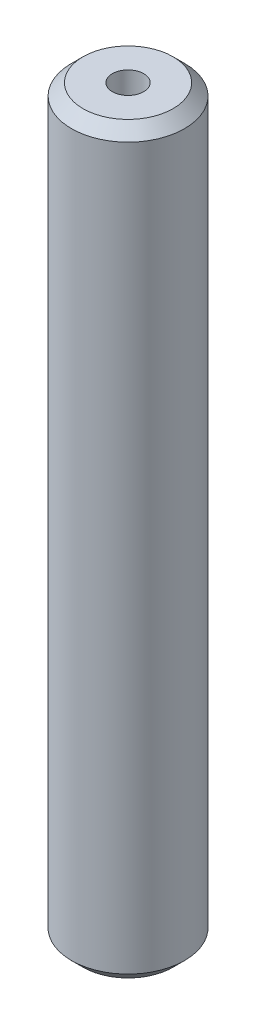
ISO-10303-21;
HEADER;
FILE_DESCRIPTION(('STEP AP214'),'2;1');
FILE_NAME('part.step','',(''),(''),'','','');
FILE_SCHEMA(('AUTOMOTIVE_DESIGN { 1 0 10303 214 1 1 1 1 }'));
ENDSEC;
DATA;
#1=APPLICATION_CONTEXT('core data for automotive mechanical design processes');
#2=APPLICATION_PROTOCOL_DEFINITION('international standard','automotive_design',2000,#1);
#3=PRODUCT_CONTEXT('',#1,'mechanical');
#4=PRODUCT('Part','Part','',(#3));
#5=PRODUCT_RELATED_PRODUCT_CATEGORY('part','',(#4));
#6=PRODUCT_DEFINITION_FORMATION('','',#4);
#7=PRODUCT_DEFINITION_CONTEXT('part definition',#1,'design');
#8=PRODUCT_DEFINITION('design','',#6,#7);
#9=PRODUCT_DEFINITION_SHAPE('','',#8);
#10=(LENGTH_UNIT() NAMED_UNIT(*) SI_UNIT(.MILLI.,.METRE.));
#11=(NAMED_UNIT(*) PLANE_ANGLE_UNIT() SI_UNIT($,.RADIAN.));
#12=(NAMED_UNIT(*) SI_UNIT($,.STERADIAN.) SOLID_ANGLE_UNIT());
#13=UNCERTAINTY_MEASURE_WITH_UNIT(LENGTH_MEASURE(1.E-05),#10,'distance_accuracy_value','');
#14=(GEOMETRIC_REPRESENTATION_CONTEXT(3) GLOBAL_UNCERTAINTY_ASSIGNED_CONTEXT((#13)) GLOBAL_UNIT_ASSIGNED_CONTEXT((#10,
#11,#12)) REPRESENTATION_CONTEXT('',''));
#15=CARTESIAN_POINT('',(0.,0.,0.));
#16=DIRECTION('',(0.,0.,1.));
#17=DIRECTION('',(1.,0.,0.));
#18=AXIS2_PLACEMENT_3D('',#15,#16,#17);
#19=CARTESIAN_POINT('',(0.,164.353961571548,0.));
#20=DIRECTION('',(0.,-1.,0.));
#21=DIRECTION('',(0.,0.,-1.));
#22=AXIS2_PLACEMENT_3D('',#19,#20,#21);
#23=CYLINDRICAL_SURFACE('',#22,12.5);
#24=CARTESIAN_POINT('',(0.,161.802368957981,0.));
#25=DIRECTION('',(0.,1.,0.));
#26=DIRECTION('',(0.,0.,1.));
#27=AXIS2_PLACEMENT_3D('',#24,#25,#26);
#28=CIRCLE('',#27,12.5);
#29=CARTESIAN_POINT('',(0.,161.802368957981,-12.5));
#30=VERTEX_POINT('',#29);
#31=EDGE_CURVE('E50',#30,#30,#28,.F.);
#32=CARTESIAN_POINT('',(0.,2.55159261356797,0.));
#33=DIRECTION('',(0.,1.,0.));
#34=DIRECTION('',(0.,0.,1.));
#35=AXIS2_PLACEMENT_3D('',#32,#33,#34);
#36=CIRCLE('',#35,12.5);
#37=CARTESIAN_POINT('',(0.,2.55159261356797,-12.5));
#38=VERTEX_POINT('',#37);
#39=EDGE_CURVE('E51',#38,#38,#36,.T.);
#40=CARTESIAN_POINT('',(0.,161.802368957981,-12.5));
#41=CARTESIAN_POINT('',(0.,160.143506704393,-12.5));
#42=CARTESIAN_POINT('',(0.,158.484644450805,-12.5));
#43=CARTESIAN_POINT('',(0.,155.16691994363,-12.5));
#44=CARTESIAN_POINT('',(0.,153.508057690042,-12.5));
#45=CARTESIAN_POINT('',(0.,150.190333182867,-12.5));
#46=CARTESIAN_POINT('',(0.,148.53147092928,-12.5));
#47=CARTESIAN_POINT('',(0.,145.213746422104,-12.5));
#48=CARTESIAN_POINT('',(0.,143.554884168517,-12.5));
#49=CARTESIAN_POINT('',(0.,140.237159661341,-12.5));
#50=CARTESIAN_POINT('',(0.,138.578297407754,-12.5));
#51=CARTESIAN_POINT('',(0.,135.260572900578,-12.5));
#52=CARTESIAN_POINT('',(0.,133.601710646991,-12.5));
#53=CARTESIAN_POINT('',(0.,130.283986139816,-12.5));
#54=CARTESIAN_POINT('',(0.,128.625123886228,-12.5));
#55=CARTESIAN_POINT('',(0.,125.307399379053,-12.5));
#56=CARTESIAN_POINT('',(0.,123.648537125465,-12.5));
#57=CARTESIAN_POINT('',(0.,120.33081261829,-12.5));
#58=CARTESIAN_POINT('',(0.,118.671950364702,-12.5));
#59=CARTESIAN_POINT('',(0.,115.354225857527,-12.5));
#60=CARTESIAN_POINT('',(0.,113.695363603939,-12.5));
#61=CARTESIAN_POINT('',(0.,110.377639096764,-12.5));
#62=CARTESIAN_POINT('',(0.,108.718776843176,-12.5));
#63=CARTESIAN_POINT('',(0.,105.401052336001,-12.5));
#64=CARTESIAN_POINT('',(0.,103.742190082414,-12.5));
#65=CARTESIAN_POINT('',(0.,100.424465575238,-12.5));
#66=CARTESIAN_POINT('',(0.,98.7656033216506,-12.5));
#67=CARTESIAN_POINT('',(0.,95.4478788144753,-12.5));
#68=CARTESIAN_POINT('',(0.,93.7890165608877,-12.5));
#69=CARTESIAN_POINT('',(0.,90.4712920537124,-12.5));
#70=CARTESIAN_POINT('',(0.,88.8124298001248,-12.5));
#71=CARTESIAN_POINT('',(0.,85.4947052929496,-12.5));
#72=CARTESIAN_POINT('',(0.,83.8358430393619,-12.5));
#73=CARTESIAN_POINT('',(0.,80.5181185321867,-12.5));
#74=CARTESIAN_POINT('',(0.,78.859256278599,-12.5));
#75=CARTESIAN_POINT('',(0.,75.5415317714237,-12.5));
#76=CARTESIAN_POINT('',(0.,73.8826695178361,-12.5));
#77=CARTESIAN_POINT('',(0.,70.5649450106609,-12.5));
#78=CARTESIAN_POINT('',(0.,68.9060827570732,-12.5));
#79=CARTESIAN_POINT('',(0.,65.588358249898,-12.5));
#80=CARTESIAN_POINT('',(0.,63.9294959963103,-12.5));
#81=CARTESIAN_POINT('',(0.,60.6117714891351,-12.5));
#82=CARTESIAN_POINT('',(0.,58.9529092355474,-12.5));
#83=CARTESIAN_POINT('',(0.,55.6351847283722,-12.5));
#84=CARTESIAN_POINT('',(0.,53.9763224747845,-12.5));
#85=CARTESIAN_POINT('',(0.,50.6585979676093,-12.5));
#86=CARTESIAN_POINT('',(0.,48.9997357140217,-12.5));
#87=CARTESIAN_POINT('',(0.,45.6820112068464,-12.5));
#88=CARTESIAN_POINT('',(0.,44.0231489532588,-12.5));
#89=CARTESIAN_POINT('',(0.,40.7054244460835,-12.5));
#90=CARTESIAN_POINT('',(0.,39.0465621924959,-12.5));
#91=CARTESIAN_POINT('',(0.,35.7288376853206,-12.5));
#92=CARTESIAN_POINT('',(0.,34.069975431733,-12.5));
#93=CARTESIAN_POINT('',(0.,30.7522509245577,-12.5));
#94=CARTESIAN_POINT('',(0.,29.0933886709701,-12.5));
#95=CARTESIAN_POINT('',(0.,25.7756641637948,-12.5));
#96=CARTESIAN_POINT('',(0.,24.1168019102072,-12.5));
#97=CARTESIAN_POINT('',(0.,20.7990774030319,-12.5));
#98=CARTESIAN_POINT('',(0.,19.1402151494443,-12.5));
#99=CARTESIAN_POINT('',(0.,15.822490642269,-12.5));
#100=CARTESIAN_POINT('',(0.,14.1636283886814,-12.5));
#101=CARTESIAN_POINT('',(0.,10.8459038815061,-12.5));
#102=CARTESIAN_POINT('',(0.,9.1870416279185,-12.5));
#103=CARTESIAN_POINT('',(0.,5.86931712074323,-12.5));
#104=CARTESIAN_POINT('',(0.,4.2104548671556,-12.5));
#105=CARTESIAN_POINT('',(0.,2.55159261356797,-12.5));
#106=B_SPLINE_CURVE_WITH_KNOTS('',3,(#40,#41,#42,#43,#44,#45,#46,#47,#48,#49,#50,#51,#52,#53,
#54,#55,#56,#57,#58,#59,#60,#61,#62,#63,#64,#65,#66,#67,#68,#69,#70,#71,#72,#73,#74,#75,#76,#77,
#78,#79,#80,#81,#82,#83,#84,#85,#86,#87,#88,#89,#90,#91,#92,#93,#94,#95,#96,#97,#98,#99,#100,
#101,#102,#103,#104,#105),.UNSPECIFIED.,.F.,.F.,(4,2,2,2,2,2,2,2,2,2,2,2,2,2,2,2,2,2,2,2,2,2,2,
2,2,2,2,2,2,2,2,2,4),(0.,4.97658676076287,9.95317352152578,14.9297602822887,19.9063470430516,
24.8829338038145,29.8595205645774,34.8361073253402,39.8126940861031,44.789280846866,
49.7658676076289,54.7424543683918,59.7190411291547,64.6956278899176,69.6722146506805,
74.6488014114434,79.6253881722063,84.6019749329692,89.5785616937321,94.555148454495,
99.5317352152579,104.508321976021,109.484908736784,114.461495497547,119.438082258309,
124.414669019072,129.391255779835,134.367842540598,139.344429301361,144.321016062124,
149.297602822887,154.27418958365,159.250776344413),.UNSPECIFIED.);
#107=EDGE_CURVE('BSEAM39',#30,#38,#106,.T.);
#108=ORIENTED_EDGE('',*,*,#31,.T.);
#109=ORIENTED_EDGE('',*,*,#39,.T.);
#110=ORIENTED_EDGE('',*,*,#107,.T.);
#111=ORIENTED_EDGE('',*,*,#107,.F.);
#112=EDGE_LOOP('',(#108,#110,#109,#111));
#113=FACE_BOUND('',#112,.T.);
#114=ADVANCED_FACE('F39',(#113),#23,.T.);
#115=CARTESIAN_POINT('',(0.,164.353961571548,0.));
#116=DIRECTION('',(0.,1.,0.));
#117=DIRECTION('',(0.,0.,1.));
#118=AXIS2_PLACEMENT_3D('',#115,#116,#117);
#119=PLANE('',#118);
#120=CARTESIAN_POINT('',(0.,164.353961571548,0.));
#121=DIRECTION('',(0.,1.,0.));
#122=DIRECTION('',(0.,0.,1.));
#123=AXIS2_PLACEMENT_3D('',#120,#121,#122);
#124=CIRCLE('',#123,9.94840738643229);
#125=CARTESIAN_POINT('',(0.,164.353961571548,9.94840738643229));
#126=VERTEX_POINT('',#125);
#127=EDGE_CURVE('E54',#126,#126,#124,.T.);
#128=ORIENTED_EDGE('',*,*,#127,.T.);
#129=EDGE_LOOP('',(#128));
#130=FACE_BOUND('',#129,.T.);
#131=CARTESIAN_POINT('',(0.,164.353961571548,0.));
#132=DIRECTION('',(0.,1.,0.));
#133=DIRECTION('',(0.,0.,1.));
#134=AXIS2_PLACEMENT_3D('',#131,#132,#133);
#135=CIRCLE('',#134,3.46270329114261);
#136=CARTESIAN_POINT('',(0.,164.353961571548,-3.46270329114261));
#137=VERTEX_POINT('',#136);
#138=EDGE_CURVE('E58',#137,#137,#135,.T.);
#139=ORIENTED_EDGE('',*,*,#138,.F.);
#140=EDGE_LOOP('',(#139));
#141=FACE_BOUND('',#140,.T.);
#142=ADVANCED_FACE('F69',(#130,#141),#119,.T.);
#143=CARTESIAN_POINT('',(0.,0.,0.));
#144=DIRECTION('',(0.,1.,0.));
#145=DIRECTION('',(0.,0.,1.));
#146=AXIS2_PLACEMENT_3D('',#143,#144,#145);
#147=PLANE('',#146);
#148=CARTESIAN_POINT('',(0.,0.,0.));
#149=DIRECTION('',(0.,1.,0.));
#150=DIRECTION('',(0.,0.,1.));
#151=AXIS2_PLACEMENT_3D('',#148,#149,#150);
#152=CIRCLE('',#151,9.94840738643202);
#153=CARTESIAN_POINT('',(0.,0.,9.94840738643202));
#154=VERTEX_POINT('',#153);
#155=EDGE_CURVE('E10',#154,#154,#152,.F.);
#156=ORIENTED_EDGE('',*,*,#155,.T.);
#157=EDGE_LOOP('',(#156));
#158=FACE_BOUND('',#157,.T.);
#159=CARTESIAN_POINT('',(0.,0.,0.));
#160=DIRECTION('',(0.,1.,0.));
#161=DIRECTION('',(0.,0.,1.));
#162=AXIS2_PLACEMENT_3D('',#159,#160,#161);
#163=CIRCLE('',#162,3.46270329114261);
#164=CARTESIAN_POINT('',(0.,0.,-3.46270329114261));
#165=VERTEX_POINT('',#164);
#166=EDGE_CURVE('E63',#165,#165,#163,.T.);
#167=ORIENTED_EDGE('',*,*,#166,.T.);
#168=EDGE_LOOP('',(#167));
#169=FACE_BOUND('',#168,.T.);
#170=ADVANCED_FACE('F75',(#158,#169),#147,.F.);
#171=CARTESIAN_POINT('',(0.,164.353961571548,0.));
#172=DIRECTION('',(0.,-1.,0.));
#173=DIRECTION('',(0.,0.,-1.));
#174=AXIS2_PLACEMENT_3D('',#171,#172,#173);
#175=CYLINDRICAL_SURFACE('',#174,3.46270329114261);
#176=CARTESIAN_POINT('',(0.,164.353961571548,-3.46270329114261));
#177=CARTESIAN_POINT('',(0.,162.641941138511,-3.46270329114261));
#178=CARTESIAN_POINT('',(0.,160.929920705474,-3.46270329114261));
#179=CARTESIAN_POINT('',(0.,157.5058798394,-3.46270329114261));
#180=CARTESIAN_POINT('',(0.,155.793859406364,-3.46270329114261));
#181=CARTESIAN_POINT('',(0.,152.36981854029,-3.46270329114261));
#182=CARTESIAN_POINT('',(0.,150.657798107253,-3.46270329114261));
#183=CARTESIAN_POINT('',(0.,147.233757241179,-3.46270329114261));
#184=CARTESIAN_POINT('',(0.,145.521736808142,-3.46270329114261));
#185=CARTESIAN_POINT('',(0.,142.097695942068,-3.46270329114261));
#186=CARTESIAN_POINT('',(0.,140.385675509031,-3.46270329114261));
#187=CARTESIAN_POINT('',(0.,136.961634642957,-3.46270329114261));
#188=CARTESIAN_POINT('',(0.,135.24961420992,-3.46270329114261));
#189=CARTESIAN_POINT('',(0.,131.825573343846,-3.46270329114261));
#190=CARTESIAN_POINT('',(0.,130.113552910809,-3.46270329114261));
#191=CARTESIAN_POINT('',(0.,126.689512044735,-3.46270329114261));
#192=CARTESIAN_POINT('',(0.,124.977491611698,-3.46270329114261));
#193=CARTESIAN_POINT('',(0.,121.553450745624,-3.46270329114261));
#194=CARTESIAN_POINT('',(0.,119.841430312587,-3.46270329114261));
#195=CARTESIAN_POINT('',(0.,116.417389446513,-3.46270329114261));
#196=CARTESIAN_POINT('',(0.,114.705369013476,-3.46270329114261));
#197=CARTESIAN_POINT('',(0.,111.281328147403,-3.46270329114261));
#198=CARTESIAN_POINT('',(0.,109.569307714366,-3.46270329114261));
#199=CARTESIAN_POINT('',(0.,106.145266848292,-3.46270329114261));
#200=CARTESIAN_POINT('',(0.,104.433246415255,-3.46270329114261));
#201=CARTESIAN_POINT('',(0.,101.009205549181,-3.46270329114261));
#202=CARTESIAN_POINT('',(0.,99.2971851161438,-3.46270329114261));
#203=CARTESIAN_POINT('',(0.,95.8731442500699,-3.46270329114261));
#204=CARTESIAN_POINT('',(0.,94.1611238170329,-3.46270329114261));
#205=CARTESIAN_POINT('',(0.,90.737082950959,-3.46270329114261));
#206=CARTESIAN_POINT('',(0.,89.025062517922,-3.46270329114261));
#207=CARTESIAN_POINT('',(0.,85.6010216518481,-3.46270329114261));
#208=CARTESIAN_POINT('',(0.,83.8890012188111,-3.46270329114261));
#209=CARTESIAN_POINT('',(0.,80.4649603527372,-3.46270329114261));
#210=CARTESIAN_POINT('',(0.,78.7529399197002,-3.46270329114261));
#211=CARTESIAN_POINT('',(0.,75.3288990536263,-3.46270329114261));
#212=CARTESIAN_POINT('',(0.,73.6168786205894,-3.46270329114261));
#213=CARTESIAN_POINT('',(0.,70.1928377545154,-3.46270329114261));
#214=CARTESIAN_POINT('',(0.,68.4808173214785,-3.46270329114261));
#215=CARTESIAN_POINT('',(0.,65.0567764554045,-3.46270329114261));
#216=CARTESIAN_POINT('',(0.,63.3447560223676,-3.46270329114261));
#217=CARTESIAN_POINT('',(0.,59.9207151562937,-3.46270329114261));
#218=CARTESIAN_POINT('',(0.,58.2086947232567,-3.46270329114261));
#219=CARTESIAN_POINT('',(0.,54.7846538571828,-3.46270329114261));
#220=CARTESIAN_POINT('',(0.,53.0726334241458,-3.46270329114261));
#221=CARTESIAN_POINT('',(0.,49.6485925580719,-3.46270329114261));
#222=CARTESIAN_POINT('',(0.,47.9365721250349,-3.46270329114261));
#223=CARTESIAN_POINT('',(0.,44.512531258961,-3.46270329114261));
#224=CARTESIAN_POINT('',(0.,42.800510825924,-3.46270329114261));
#225=CARTESIAN_POINT('',(0.,39.3764699598501,-3.46270329114261));
#226=CARTESIAN_POINT('',(0.,37.6644495268132,-3.46270329114261));
#227=CARTESIAN_POINT('',(0.,34.2404086607392,-3.46270329114261));
#228=CARTESIAN_POINT('',(0.,32.5283882277023,-3.46270329114261));
#229=CARTESIAN_POINT('',(0.,29.1043473616284,-3.46270329114261));
#230=CARTESIAN_POINT('',(0.,27.3923269285914,-3.46270329114261));
#231=CARTESIAN_POINT('',(0.,23.9682860625175,-3.46270329114261));
#232=CARTESIAN_POINT('',(0.,22.2562656294805,-3.46270329114261));
#233=CARTESIAN_POINT('',(0.,18.8322247634066,-3.46270329114261));
#234=CARTESIAN_POINT('',(0.,17.1202043303696,-3.46270329114261));
#235=CARTESIAN_POINT('',(0.,13.6961634642957,-3.46270329114261));
#236=CARTESIAN_POINT('',(0.,11.9841430312587,-3.46270329114261));
#237=CARTESIAN_POINT('',(0.,8.56010216518481,-3.46270329114261));
#238=CARTESIAN_POINT('',(0.,6.84808173214784,-3.46270329114261));
#239=CARTESIAN_POINT('',(0.,3.42404086607391,-3.46270329114261));
#240=CARTESIAN_POINT('',(0.,1.71202043303696,-3.46270329114261));
#241=CARTESIAN_POINT('',(0.,0.,-3.46270329114261));
#242=B_SPLINE_CURVE_WITH_KNOTS('',3,(#176,#177,#178,#179,#180,#181,#182,#183,#184,#185,#186,
#187,#188,#189,#190,#191,#192,#193,#194,#195,#196,#197,#198,#199,#200,#201,#202,#203,#204,#205,
#206,#207,#208,#209,#210,#211,#212,#213,#214,#215,#216,#217,#218,#219,#220,#221,#222,#223,#224,
#225,#226,#227,#228,#229,#230,#231,#232,#233,#234,#235,#236,#237,#238,#239,#240,#241),
.UNSPECIFIED.,.F.,.F.,(4,2,2,2,2,2,2,2,2,2,2,2,2,2,2,2,2,2,2,2,2,2,2,2,2,2,2,2,2,2,2,2,4),(0.,
5.13606129911087,10.2721225982217,15.4081838973326,20.5442451964435,25.6803064955544,
30.8163677946653,35.9524290937762,41.0884903928871,46.2245516919979,51.3606129911088,
56.4966742902197,61.6327355893306,66.7687968884415,71.9048581875524,77.0409194866633,
82.1769807857741,87.313042084885,92.4491033839959,97.5851646831068,102.721225982218,
107.857287281329,112.993348580439,118.12940987955,123.265471178661,128.401532477772,
133.537593776883,138.673655075994,143.809716375105,148.945777674216,154.081838973327,
159.217900272437,164.353961571548),.UNSPECIFIED.);
#243=EDGE_CURVE('BSEAM70',#137,#165,#242,.T.);
#244=ORIENTED_EDGE('',*,*,#138,.T.);
#245=ORIENTED_EDGE('',*,*,#166,.F.);
#246=ORIENTED_EDGE('',*,*,#243,.T.);
#247=ORIENTED_EDGE('',*,*,#243,.F.);
#248=EDGE_LOOP('',(#244,#246,#245,#247));
#249=FACE_BOUND('',#248,.T.);
#250=ADVANCED_FACE('F70',(#249),#175,.F.);
#251=CARTESIAN_POINT('',(0.,164.353961571548,0.));
#252=DIRECTION('',(0.,-1.,0.));
#253=DIRECTION('',(0.,0.,-1.));
#254=AXIS2_PLACEMENT_3D('',#251,#252,#253);
#255=CONICAL_SURFACE('',#254,9.94840738643229,0.785398163397447);
#256=ORIENTED_EDGE('',*,*,#31,.F.);
#257=EDGE_LOOP('',(#256));
#258=FACE_BOUND('',#257,.T.);
#259=ORIENTED_EDGE('',*,*,#127,.F.);
#260=EDGE_LOOP('',(#259));
#261=FACE_BOUND('',#260,.T.);
#262=ADVANCED_FACE('F81',(#258,#261),#255,.T.);
#263=CARTESIAN_POINT('',(0.,2.55159261356797,0.));
#264=DIRECTION('',(0.,1.,0.));
#265=DIRECTION('',(0.,0.,1.));
#266=AXIS2_PLACEMENT_3D('',#263,#264,#265);
#267=CONICAL_SURFACE('',#266,12.5,0.785398163397452);
#268=ORIENTED_EDGE('',*,*,#155,.F.);
#269=EDGE_LOOP('',(#268));
#270=FACE_BOUND('',#269,.T.);
#271=ORIENTED_EDGE('',*,*,#39,.F.);
#272=EDGE_LOOP('',(#271));
#273=FACE_BOUND('',#272,.T.);
#274=ADVANCED_FACE('F45',(#270,#273),#267,.T.);
#275=CLOSED_SHELL('',(#114,#142,#170,#250,#262,#274));
#276=MANIFOLD_SOLID_BREP('B2',#275);
#277=ADVANCED_BREP_SHAPE_REPRESENTATION('',(#18,#276),#14);
#278=SHAPE_DEFINITION_REPRESENTATION(#9,#277);
ENDSEC;
END-ISO-10303-21;
